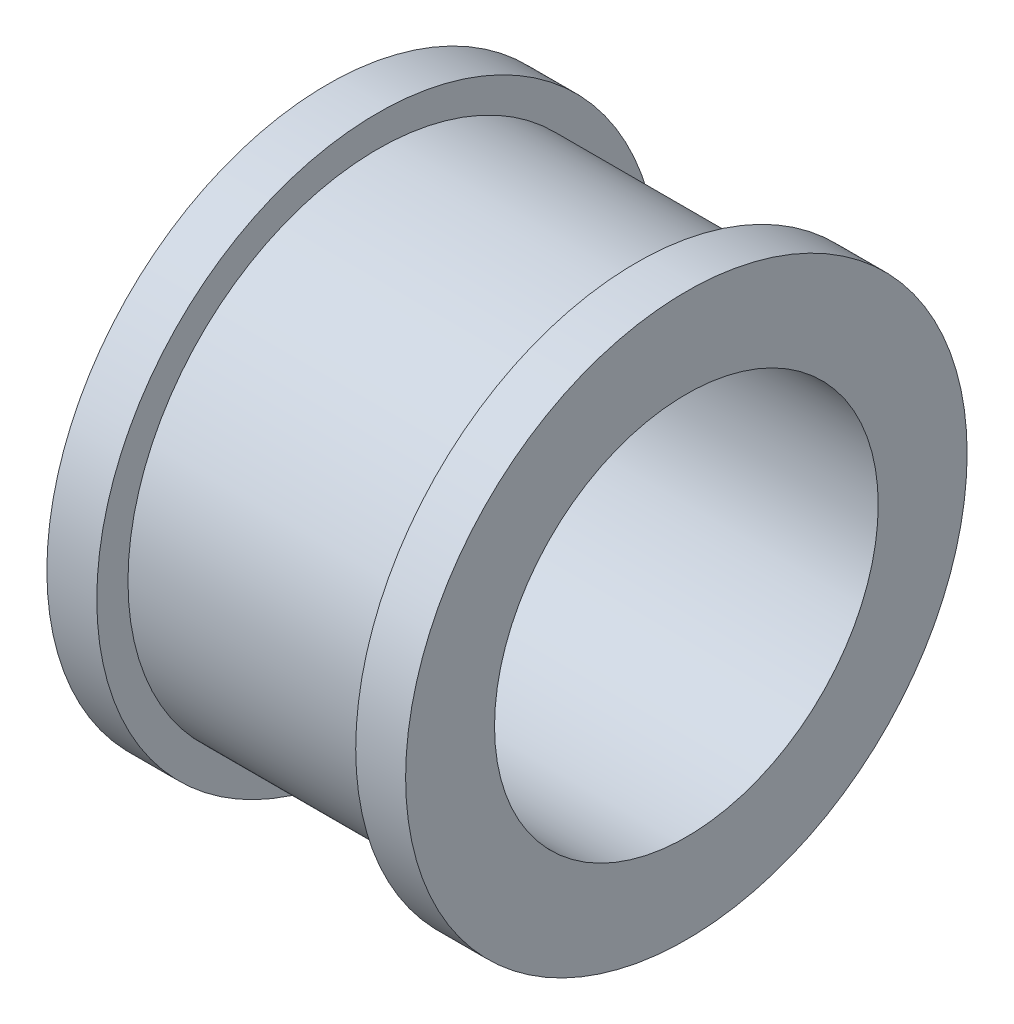
ISO-10303-21;
HEADER;
FILE_DESCRIPTION(('STEP AP214'),'2;1');
FILE_NAME('part.step','',(''),(''),'','','');
FILE_SCHEMA(('AUTOMOTIVE_DESIGN { 1 0 10303 214 1 1 1 1 }'));
ENDSEC;
DATA;
#1=APPLICATION_CONTEXT('core data for automotive mechanical design processes');
#2=APPLICATION_PROTOCOL_DEFINITION('international standard','automotive_design',2000,#1);
#3=PRODUCT_CONTEXT('',#1,'mechanical');
#4=PRODUCT('Part','Part','',(#3));
#5=PRODUCT_RELATED_PRODUCT_CATEGORY('part','',(#4));
#6=PRODUCT_DEFINITION_FORMATION('','',#4);
#7=PRODUCT_DEFINITION_CONTEXT('part definition',#1,'design');
#8=PRODUCT_DEFINITION('design','',#6,#7);
#9=PRODUCT_DEFINITION_SHAPE('','',#8);
#10=(LENGTH_UNIT() NAMED_UNIT(*) SI_UNIT(.MILLI.,.METRE.));
#11=(NAMED_UNIT(*) PLANE_ANGLE_UNIT() SI_UNIT($,.RADIAN.));
#12=(NAMED_UNIT(*) SI_UNIT($,.STERADIAN.) SOLID_ANGLE_UNIT());
#13=UNCERTAINTY_MEASURE_WITH_UNIT(LENGTH_MEASURE(1.E-05),#10,'distance_accuracy_value','');
#14=(GEOMETRIC_REPRESENTATION_CONTEXT(3) GLOBAL_UNCERTAINTY_ASSIGNED_CONTEXT((#13)) GLOBAL_UNIT_ASSIGNED_CONTEXT((#10,
#11,#12)) REPRESENTATION_CONTEXT('',''));
#15=CARTESIAN_POINT('',(0.,0.,0.));
#16=DIRECTION('',(0.,0.,1.));
#17=DIRECTION('',(1.,0.,0.));
#18=AXIS2_PLACEMENT_3D('',#15,#16,#17);
#19=CARTESIAN_POINT('',(-2.875,1.5,0.));
#20=DIRECTION('',(1.,0.,0.));
#21=DIRECTION('',(0.,0.,-1.));
#22=AXIS2_PLACEMENT_3D('',#19,#20,#21);
#23=PLANE('',#22);
#24=CARTESIAN_POINT('',(-2.875,0.,0.));
#25=DIRECTION('',(-1.,0.,0.));
#26=DIRECTION('',(0.,0.,1.));
#27=AXIS2_PLACEMENT_3D('',#24,#25,#26);
#28=CIRCLE('',#27,4.5);
#29=CARTESIAN_POINT('',(-2.875,0.,4.5));
#30=VERTEX_POINT('',#29);
#31=EDGE_CURVE('E10',#30,#30,#28,.T.);
#32=ORIENTED_EDGE('',*,*,#31,.T.);
#33=EDGE_LOOP('',(#32));
#34=FACE_BOUND('',#33,.T.);
#35=CARTESIAN_POINT('',(-2.875,0.,0.));
#36=DIRECTION('',(1.,0.,0.));
#37=DIRECTION('',(0.,0.,-1.));
#38=AXIS2_PLACEMENT_3D('',#35,#36,#37);
#39=CIRCLE('',#38,3.075);
#40=CARTESIAN_POINT('',(-2.875,0.,-3.075));
#41=VERTEX_POINT('',#40);
#42=EDGE_CURVE('E61',#41,#41,#39,.T.);
#43=ORIENTED_EDGE('',*,*,#42,.T.);
#44=EDGE_LOOP('',(#43));
#45=FACE_BOUND('',#44,.T.);
#46=ADVANCED_FACE('F33',(#34,#45),#23,.F.);
#47=CARTESIAN_POINT('',(2.875,4.5,0.));
#48=DIRECTION('',(-1.,0.,0.));
#49=DIRECTION('',(0.,0.,1.));
#50=AXIS2_PLACEMENT_3D('',#47,#48,#49);
#51=PLANE('',#50);
#52=CARTESIAN_POINT('',(2.875,0.,0.));
#53=DIRECTION('',(-1.,0.,0.));
#54=DIRECTION('',(0.,0.,1.));
#55=AXIS2_PLACEMENT_3D('',#52,#53,#54);
#56=CIRCLE('',#55,4.5);
#57=CARTESIAN_POINT('',(2.875,0.,4.5));
#58=VERTEX_POINT('',#57);
#59=EDGE_CURVE('E55',#58,#58,#56,.T.);
#60=ORIENTED_EDGE('',*,*,#59,.F.);
#61=EDGE_LOOP('',(#60));
#62=FACE_BOUND('',#61,.T.);
#63=CARTESIAN_POINT('',(2.875,0.,0.));
#64=DIRECTION('',(1.,0.,0.));
#65=DIRECTION('',(0.,0.,-1.));
#66=AXIS2_PLACEMENT_3D('',#63,#64,#65);
#67=CIRCLE('',#66,3.075);
#68=CARTESIAN_POINT('',(2.875,0.,-3.075));
#69=VERTEX_POINT('',#68);
#70=EDGE_CURVE('E58',#69,#69,#67,.T.);
#71=ORIENTED_EDGE('',*,*,#70,.F.);
#72=EDGE_LOOP('',(#71));
#73=FACE_BOUND('',#72,.T.);
#74=ADVANCED_FACE('F79',(#62,#73),#51,.F.);
#75=CARTESIAN_POINT('',(0.,0.,0.));
#76=DIRECTION('',(-1.,0.,0.));
#77=DIRECTION('',(0.,0.,1.));
#78=AXIS2_PLACEMENT_3D('',#75,#76,#77);
#79=CYLINDRICAL_SURFACE('',#78,4.5);
#80=ORIENTED_EDGE('',*,*,#31,.F.);
#81=EDGE_LOOP('',(#80));
#82=FACE_BOUND('',#81,.T.);
#83=CARTESIAN_POINT('',(-2.075,0.,0.));
#84=DIRECTION('',(-1.,0.,0.));
#85=DIRECTION('',(0.,0.,1.));
#86=AXIS2_PLACEMENT_3D('',#83,#84,#85);
#87=CIRCLE('',#86,4.5);
#88=CARTESIAN_POINT('',(-2.075,0.,4.5));
#89=VERTEX_POINT('',#88);
#90=EDGE_CURVE('E39',#89,#89,#87,.T.);
#91=ORIENTED_EDGE('',*,*,#90,.T.);
#92=EDGE_LOOP('',(#91));
#93=FACE_BOUND('',#92,.T.);
#94=ADVANCED_FACE('F83',(#82,#93),#79,.T.);
#95=CARTESIAN_POINT('',(-2.075,4.5,0.));
#96=DIRECTION('',(-1.,0.,0.));
#97=DIRECTION('',(0.,0.,1.));
#98=AXIS2_PLACEMENT_3D('',#95,#96,#97);
#99=PLANE('',#98);
#100=ORIENTED_EDGE('',*,*,#90,.F.);
#101=EDGE_LOOP('',(#100));
#102=FACE_BOUND('',#101,.T.);
#103=CARTESIAN_POINT('',(-2.075,0.,0.));
#104=DIRECTION('',(-1.,0.,0.));
#105=DIRECTION('',(0.,0.,1.));
#106=AXIS2_PLACEMENT_3D('',#103,#104,#105);
#107=CIRCLE('',#106,4.);
#108=CARTESIAN_POINT('',(-2.075,0.,4.));
#109=VERTEX_POINT('',#108);
#110=EDGE_CURVE('E43',#109,#109,#107,.T.);
#111=ORIENTED_EDGE('',*,*,#110,.T.);
#112=EDGE_LOOP('',(#111));
#113=FACE_BOUND('',#112,.T.);
#114=ADVANCED_FACE('F88',(#102,#113),#99,.F.);
#115=CARTESIAN_POINT('',(0.,0.,0.));
#116=DIRECTION('',(-1.,0.,0.));
#117=DIRECTION('',(0.,0.,1.));
#118=AXIS2_PLACEMENT_3D('',#115,#116,#117);
#119=CYLINDRICAL_SURFACE('',#118,4.);
#120=ORIENTED_EDGE('',*,*,#110,.F.);
#121=EDGE_LOOP('',(#120));
#122=FACE_BOUND('',#121,.T.);
#123=CARTESIAN_POINT('',(2.075,0.,0.));
#124=DIRECTION('',(-1.,0.,0.));
#125=DIRECTION('',(0.,0.,1.));
#126=AXIS2_PLACEMENT_3D('',#123,#124,#125);
#127=CIRCLE('',#126,4.);
#128=CARTESIAN_POINT('',(2.075,0.,4.));
#129=VERTEX_POINT('',#128);
#130=EDGE_CURVE('E47',#129,#129,#127,.T.);
#131=ORIENTED_EDGE('',*,*,#130,.T.);
#132=EDGE_LOOP('',(#131));
#133=FACE_BOUND('',#132,.T.);
#134=ADVANCED_FACE('F95',(#122,#133),#119,.T.);
#135=CARTESIAN_POINT('',(2.075,4.,0.));
#136=DIRECTION('',(1.,0.,0.));
#137=DIRECTION('',(0.,0.,-1.));
#138=AXIS2_PLACEMENT_3D('',#135,#136,#137);
#139=PLANE('',#138);
#140=ORIENTED_EDGE('',*,*,#130,.F.);
#141=EDGE_LOOP('',(#140));
#142=FACE_BOUND('',#141,.T.);
#143=CARTESIAN_POINT('',(2.075,0.,0.));
#144=DIRECTION('',(-1.,0.,0.));
#145=DIRECTION('',(0.,0.,1.));
#146=AXIS2_PLACEMENT_3D('',#143,#144,#145);
#147=CIRCLE('',#146,4.5);
#148=CARTESIAN_POINT('',(2.075,0.,4.5));
#149=VERTEX_POINT('',#148);
#150=EDGE_CURVE('E52',#149,#149,#147,.T.);
#151=ORIENTED_EDGE('',*,*,#150,.T.);
#152=EDGE_LOOP('',(#151));
#153=FACE_BOUND('',#152,.T.);
#154=ADVANCED_FACE('F74',(#142,#153),#139,.F.);
#155=CARTESIAN_POINT('',(0.,0.,0.));
#156=DIRECTION('',(-1.,0.,0.));
#157=DIRECTION('',(0.,0.,1.));
#158=AXIS2_PLACEMENT_3D('',#155,#156,#157);
#159=CYLINDRICAL_SURFACE('',#158,4.5);
#160=ORIENTED_EDGE('',*,*,#150,.F.);
#161=EDGE_LOOP('',(#160));
#162=FACE_BOUND('',#161,.T.);
#163=ORIENTED_EDGE('',*,*,#59,.T.);
#164=EDGE_LOOP('',(#163));
#165=FACE_BOUND('',#164,.T.);
#166=ADVANCED_FACE('F68',(#162,#165),#159,.T.);
#167=CARTESIAN_POINT('',(2.875,0.,0.));
#168=DIRECTION('',(-1.,0.,0.));
#169=DIRECTION('',(0.,0.,1.));
#170=AXIS2_PLACEMENT_3D('',#167,#168,#169);
#171=CYLINDRICAL_SURFACE('',#170,3.075);
#172=ORIENTED_EDGE('',*,*,#70,.T.);
#173=EDGE_LOOP('',(#172));
#174=FACE_BOUND('',#173,.T.);
#175=ORIENTED_EDGE('',*,*,#42,.F.);
#176=EDGE_LOOP('',(#175));
#177=FACE_BOUND('',#176,.T.);
#178=ADVANCED_FACE('F66',(#174,#177),#171,.F.);
#179=CLOSED_SHELL('',(#46,#74,#94,#114,#134,#154,#166,#178));
#180=MANIFOLD_SOLID_BREP('B2',#179);
#181=ADVANCED_BREP_SHAPE_REPRESENTATION('',(#18,#180),#14);
#182=SHAPE_DEFINITION_REPRESENTATION(#9,#181);
ENDSEC;
END-ISO-10303-21;
